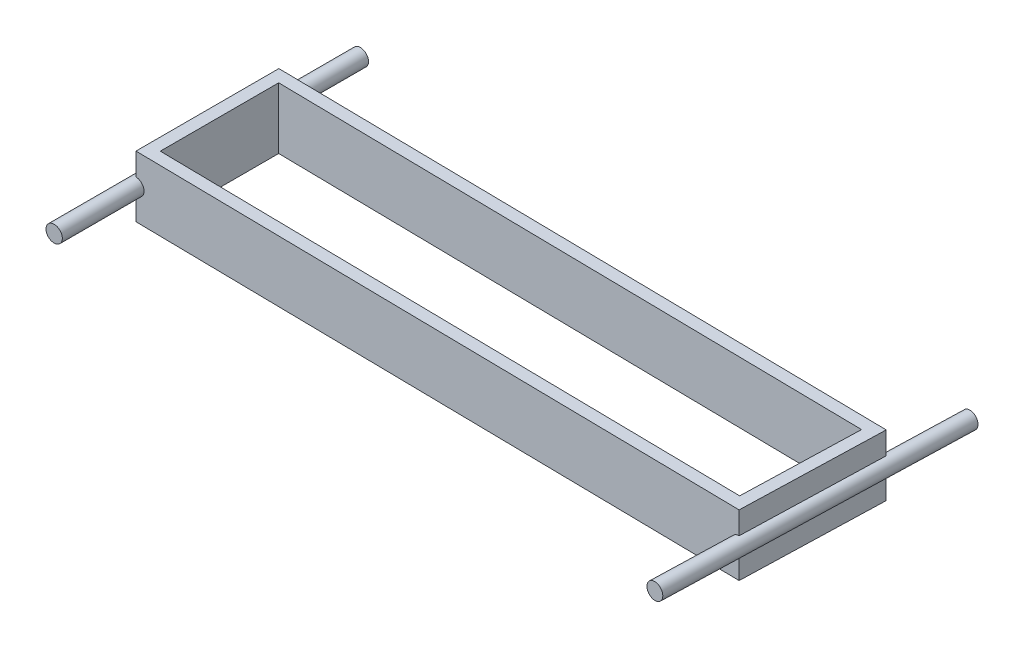
ISO-10303-21;
HEADER;
FILE_DESCRIPTION(('STEP AP214'),'2;1');
FILE_NAME('part.step','',(''),(''),'','','');
FILE_SCHEMA(('AUTOMOTIVE_DESIGN { 1 0 10303 214 1 1 1 1 }'));
ENDSEC;
DATA;
#1=APPLICATION_CONTEXT('core data for automotive mechanical design processes');
#2=APPLICATION_PROTOCOL_DEFINITION('international standard','automotive_design',2000,#1);
#3=PRODUCT_CONTEXT('',#1,'mechanical');
#4=PRODUCT('Part','Part','',(#3));
#5=PRODUCT_RELATED_PRODUCT_CATEGORY('part','',(#4));
#6=PRODUCT_DEFINITION_FORMATION('','',#4);
#7=PRODUCT_DEFINITION_CONTEXT('part definition',#1,'design');
#8=PRODUCT_DEFINITION('design','',#6,#7);
#9=PRODUCT_DEFINITION_SHAPE('','',#8);
#10=(LENGTH_UNIT() NAMED_UNIT(*) SI_UNIT(.MILLI.,.METRE.));
#11=(NAMED_UNIT(*) PLANE_ANGLE_UNIT() SI_UNIT($,.RADIAN.));
#12=(NAMED_UNIT(*) SI_UNIT($,.STERADIAN.) SOLID_ANGLE_UNIT());
#13=UNCERTAINTY_MEASURE_WITH_UNIT(LENGTH_MEASURE(1.E-05),#10,'distance_accuracy_value','');
#14=(GEOMETRIC_REPRESENTATION_CONTEXT(3) GLOBAL_UNCERTAINTY_ASSIGNED_CONTEXT((#13)) GLOBAL_UNIT_ASSIGNED_CONTEXT((#10,
#11,#12)) REPRESENTATION_CONTEXT('',''));
#15=CARTESIAN_POINT('',(0.,0.,0.));
#16=DIRECTION('',(0.,0.,1.));
#17=DIRECTION('',(1.,0.,0.));
#18=AXIS2_PLACEMENT_3D('',#15,#16,#17);
#19=CARTESIAN_POINT('',(57.3784840671414,-38.1,50.0506871390915));
#20=DIRECTION('',(0.99955,0.,0.0299966248101393));
#21=DIRECTION('',(0.0299966248101393,0.,-0.99955));
#22=AXIS2_PLACEMENT_3D('',#19,#20,#21);
#23=PLANE('',#22);
#24=DIRECTION('',(0.0299966248101393,0.,-0.99955));
#25=VECTOR('',#24,1.);
#26=CARTESIAN_POINT('',(55.8512265267866,-24.13,100.942088559213));
#27=LINE('',#26,#25);
#28=CARTESIAN_POINT('',(57.3784840671414,-24.13,50.0506871390915));
#29=VERTEX_POINT('',#28);
#30=CARTESIAN_POINT('',(60.0451840127628,-24.13,-38.8093078609085));
#31=VERTEX_POINT('',#30);
#32=EDGE_CURVE('E138',#29,#31,#27,.T.);
#33=ORIENTED_EDGE('',*,*,#32,.F.);
#34=DIRECTION('',(0.,1.,0.));
#35=VECTOR('',#34,1.);
#36=CARTESIAN_POINT('',(57.3784840671414,-38.1,50.0506871390915));
#37=LINE('',#36,#35);
#38=CARTESIAN_POINT('',(57.3784840671414,-38.1,50.0506871390915));
#39=VERTEX_POINT('',#38);
#40=EDGE_CURVE('E126',#39,#29,#37,.T.);
#41=ORIENTED_EDGE('',*,*,#40,.F.);
#42=DIRECTION('',(0.0299966248101393,0.,-0.99955));
#43=VECTOR('',#42,1.);
#44=CARTESIAN_POINT('',(57.3784840671414,-38.1,50.0506871390915));
#45=LINE('',#44,#43);
#46=CARTESIAN_POINT('',(60.0451840127628,-38.1,-38.8093078609085));
#47=VERTEX_POINT('',#46);
#48=EDGE_CURVE('E205',#39,#47,#45,.T.);
#49=ORIENTED_EDGE('',*,*,#48,.T.);
#50=DIRECTION('',(0.,1.,0.));
#51=VECTOR('',#50,1.);
#52=CARTESIAN_POINT('',(60.0451840127628,-38.1,-38.8093078609085));
#53=LINE('',#52,#51);
#54=EDGE_CURVE('E139',#47,#31,#53,.T.);
#55=ORIENTED_EDGE('',*,*,#54,.T.);
#56=EDGE_LOOP('',(#33,#41,#49,#55));
#57=FACE_BOUND('',#56,.T.);
#58=ADVANCED_FACE('F37',(#57),#23,.T.);
#59=CARTESIAN_POINT('',(-323.578651021572,-38.1,44.3356871390794));
#60=DIRECTION('',(-1.,0.,0.));
#61=DIRECTION('',(0.,0.,1.));
#62=AXIS2_PLACEMENT_3D('',#59,#60,#61);
#63=PLANE('',#62);
#64=DIRECTION('',(0.,1.,0.));
#65=VECTOR('',#64,1.);
#66=CARTESIAN_POINT('',(-323.578651021572,-38.1,-44.5643128609206));
#67=LINE('',#66,#65);
#68=CARTESIAN_POINT('',(-323.578651021572,-13.97,-44.5643128609206));
#69=VERTEX_POINT('',#68);
#70=CARTESIAN_POINT('',(-323.578651021572,0.,-44.5643128609206));
#71=VERTEX_POINT('',#70);
#72=EDGE_CURVE('E224',#69,#71,#67,.T.);
#73=ORIENTED_EDGE('',*,*,#72,.F.);
#74=DIRECTION('',(0.,0.,-1.));
#75=VECTOR('',#74,1.);
#76=CARTESIAN_POINT('',(-323.578651021572,-13.97,95.25));
#77=LINE('',#76,#75);
#78=CARTESIAN_POINT('',(-323.578651021572,-13.9700000000001,44.3356871390794));
#79=VERTEX_POINT('',#78);
#80=EDGE_CURVE('E161',#69,#79,#77,.F.);
#81=ORIENTED_EDGE('',*,*,#80,.T.);
#82=DIRECTION('',(0.,1.,0.));
#83=VECTOR('',#82,1.);
#84=CARTESIAN_POINT('',(-323.578651021572,-38.1,44.3356871390794));
#85=LINE('',#84,#83);
#86=CARTESIAN_POINT('',(-323.578651021572,0.,44.3356871390794));
#87=VERTEX_POINT('',#86);
#88=EDGE_CURVE('E210',#79,#87,#85,.T.);
#89=ORIENTED_EDGE('',*,*,#88,.T.);
#90=DIRECTION('',(0.,0.,1.));
#91=VECTOR('',#90,1.);
#92=CARTESIAN_POINT('',(-323.578651021572,0.,44.3356871390794));
#93=LINE('',#92,#91);
#94=EDGE_CURVE('E193',#71,#87,#93,.T.);
#95=ORIENTED_EDGE('',*,*,#94,.F.);
#96=EDGE_LOOP('',(#73,#81,#89,#95));
#97=FACE_BOUND('',#96,.T.);
#98=ADVANCED_FACE('F39',(#97),#63,.T.);
#99=CARTESIAN_POINT('',(-323.578651021572,-38.1,44.3356871390794));
#100=VERTEX_POINT('',#99);
#101=CARTESIAN_POINT('',(-323.578651021572,-24.13,44.3356871390794));
#102=VERTEX_POINT('',#101);
#103=EDGE_CURVE('E226',#100,#102,#85,.T.);
#104=ORIENTED_EDGE('',*,*,#103,.T.);
#105=DIRECTION('',(0.,0.,-1.));
#106=VECTOR('',#105,1.);
#107=CARTESIAN_POINT('',(-323.578651021572,-24.13,95.25));
#108=LINE('',#107,#106);
#109=CARTESIAN_POINT('',(-323.578651021572,-24.13,-44.5643128609206));
#110=VERTEX_POINT('',#109);
#111=EDGE_CURVE('E156',#102,#110,#108,.T.);
#112=ORIENTED_EDGE('',*,*,#111,.T.);
#113=CARTESIAN_POINT('',(-323.578651021572,-38.1,-44.5643128609206));
#114=VERTEX_POINT('',#113);
#115=EDGE_CURVE('E221',#114,#110,#67,.T.);
#116=ORIENTED_EDGE('',*,*,#115,.F.);
#117=DIRECTION('',(0.,0.,1.));
#118=VECTOR('',#117,1.);
#119=CARTESIAN_POINT('',(-323.578651021572,-38.1,44.3356871390794));
#120=LINE('',#119,#118);
#121=EDGE_CURVE('E200',#114,#100,#120,.T.);
#122=ORIENTED_EDGE('',*,*,#121,.T.);
#123=EDGE_LOOP('',(#104,#112,#116,#122));
#124=FACE_BOUND('',#123,.T.);
#125=ADVANCED_FACE('F233',(#124),#63,.T.);
#126=CARTESIAN_POINT('',(-323.578651021572,-38.1,-44.5643128609206));
#127=DIRECTION('',(0.0150000000000314,0.,-0.999887493671162));
#128=DIRECTION('',(-0.999887493671163,0.,-0.0150000000000314));
#129=AXIS2_PLACEMENT_3D('',#126,#127,#128);
#130=PLANE('',#129);
#131=CARTESIAN_POINT('',(60.0451840127626,-19.05,-38.8093078609085));
#132=DIRECTION('',(0.0150000000000314,0.,-0.999887493671162));
#133=DIRECTION('',(0.999887493671163,0.,0.0150000000000314));
#134=AXIS2_PLACEMENT_3D('',#131,#132,#133);
#135=ELLIPSE('',#134,5.08057159645867,5.07999999999996);
#136=CARTESIAN_POINT('',(60.0451840127628,-13.97,-38.8093078609085));
#137=VERTEX_POINT('',#136);
#138=EDGE_CURVE('E59',#31,#137,#135,.T.);
#139=ORIENTED_EDGE('',*,*,#138,.F.);
#140=ORIENTED_EDGE('',*,*,#54,.F.);
#141=DIRECTION('',(-0.999887493671162,0.,-0.0150000000000314));
#142=VECTOR('',#141,1.);
#143=CARTESIAN_POINT('',(-323.578651021572,-38.1,-44.5643128609206));
#144=LINE('',#143,#142);
#145=EDGE_CURVE('E207',#47,#114,#144,.T.);
#146=ORIENTED_EDGE('',*,*,#145,.T.);
#147=ORIENTED_EDGE('',*,*,#115,.T.);
#148=CARTESIAN_POINT('',(-323.578651021572,-19.05,-44.5643128609206));
#149=DIRECTION('',(0.0150000000000314,0.,-0.999887493671162));
#150=DIRECTION('',(-0.999887493671163,0.,-0.0150000000000314));
#151=AXIS2_PLACEMENT_3D('',#148,#149,#150);
#152=ELLIPSE('',#151,5.08057159645868,5.07999999999996);
#153=EDGE_CURVE('E164',#110,#69,#152,.F.);
#154=ORIENTED_EDGE('',*,*,#153,.T.);
#155=ORIENTED_EDGE('',*,*,#72,.T.);
#156=DIRECTION('',(-0.999887493671162,0.,-0.0150000000000314));
#157=VECTOR('',#156,1.);
#158=CARTESIAN_POINT('',(-323.578651021572,0.,-44.5643128609206));
#159=LINE('',#158,#157);
#160=CARTESIAN_POINT('',(60.0451840127628,0.,-38.8093078609085));
#161=VERTEX_POINT('',#160);
#162=EDGE_CURVE('E203',#161,#71,#159,.T.);
#163=ORIENTED_EDGE('',*,*,#162,.F.);
#164=EDGE_CURVE('E134',#137,#161,#53,.T.);
#165=ORIENTED_EDGE('',*,*,#164,.F.);
#166=EDGE_LOOP('',(#139,#140,#146,#147,#154,#155,#163,#165));
#167=FACE_BOUND('',#166,.T.);
#168=ADVANCED_FACE('F238',(#167),#130,.T.);
#169=DIRECTION('',(0.0299966248101393,0.,-0.99955));
#170=VECTOR('',#169,1.);
#171=CARTESIAN_POINT('',(55.8512265267866,-13.97,100.942088559213));
#172=LINE('',#171,#170);
#173=CARTESIAN_POINT('',(57.3784840671414,-13.97,50.0506871390915));
#174=VERTEX_POINT('',#173);
#175=EDGE_CURVE('E52',#137,#174,#172,.F.);
#176=ORIENTED_EDGE('',*,*,#175,.F.);
#177=ORIENTED_EDGE('',*,*,#164,.T.);
#178=DIRECTION('',(0.0299966248101393,0.,-0.99955));
#179=VECTOR('',#178,1.);
#180=CARTESIAN_POINT('',(57.3784840671414,0.,50.0506871390915));
#181=LINE('',#180,#179);
#182=CARTESIAN_POINT('',(57.3784840671414,0.,50.0506871390915));
#183=VERTEX_POINT('',#182);
#184=EDGE_CURVE('E216',#183,#161,#181,.T.);
#185=ORIENTED_EDGE('',*,*,#184,.F.);
#186=EDGE_CURVE('E135',#174,#183,#37,.T.);
#187=ORIENTED_EDGE('',*,*,#186,.F.);
#188=EDGE_LOOP('',(#176,#177,#185,#187));
#189=FACE_BOUND('',#188,.T.);
#190=ADVANCED_FACE('F246',(#189),#23,.T.);
#191=CARTESIAN_POINT('',(-323.578651021572,-38.1,44.3356871390794));
#192=DIRECTION('',(-0.0150000000000316,0.,0.999887493671162));
#193=DIRECTION('',(0.999887493671163,0.,0.0150000000000316));
#194=AXIS2_PLACEMENT_3D('',#191,#192,#193);
#195=PLANE('',#194);
#196=CARTESIAN_POINT('',(57.3784840671413,-19.05,50.0506871390915));
#197=DIRECTION('',(-0.0150000000000316,0.,0.999887493671162));
#198=DIRECTION('',(0.999887493671163,0.,0.0150000000000316));
#199=AXIS2_PLACEMENT_3D('',#196,#197,#198);
#200=ELLIPSE('',#199,5.08057159645867,5.07999999999996);
#201=EDGE_CURVE('E11',#174,#29,#200,.T.);
#202=ORIENTED_EDGE('',*,*,#201,.F.);
#203=ORIENTED_EDGE('',*,*,#186,.T.);
#204=DIRECTION('',(0.999887493671163,0.,0.0150000000000316));
#205=VECTOR('',#204,1.);
#206=CARTESIAN_POINT('',(-323.578651021572,0.,44.3356871390794));
#207=LINE('',#206,#205);
#208=EDGE_CURVE('E213',#87,#183,#207,.T.);
#209=ORIENTED_EDGE('',*,*,#208,.F.);
#210=ORIENTED_EDGE('',*,*,#88,.F.);
#211=CARTESIAN_POINT('',(-323.578651021572,-19.05,44.3356871390794));
#212=DIRECTION('',(-0.0150000000000316,0.,0.999887493671162));
#213=DIRECTION('',(-0.999887493671163,0.,-0.0150000000000316));
#214=AXIS2_PLACEMENT_3D('',#211,#212,#213);
#215=ELLIPSE('',#214,5.08057159645868,5.07999999999996);
#216=EDGE_CURVE('E45',#79,#102,#215,.F.);
#217=ORIENTED_EDGE('',*,*,#216,.T.);
#218=ORIENTED_EDGE('',*,*,#103,.F.);
#219=DIRECTION('',(0.999887493671163,0.,0.0150000000000316));
#220=VECTOR('',#219,1.);
#221=CARTESIAN_POINT('',(-323.578651021572,-38.1,44.3356871390794));
#222=LINE('',#221,#220);
#223=EDGE_CURVE('E130',#100,#39,#222,.T.);
#224=ORIENTED_EDGE('',*,*,#223,.T.);
#225=ORIENTED_EDGE('',*,*,#40,.T.);
#226=EDGE_LOOP('',(#202,#203,#209,#210,#217,#218,#224,#225));
#227=FACE_BOUND('',#226,.T.);
#228=ADVANCED_FACE('F128',(#227),#195,.T.);
#229=CARTESIAN_POINT('',(0.,-38.1,0.));
#230=DIRECTION('',(0.,-1.,0.));
#231=DIRECTION('',(0.,0.,-1.));
#232=AXIS2_PLACEMENT_3D('',#229,#230,#231);
#233=PLANE('',#232);
#234=DIRECTION('',(0.,0.,1.));
#235=VECTOR('',#234,1.);
#236=CARTESIAN_POINT('',(-315.958651021572,-38.1,36.8291426053119));
#237=LINE('',#236,#235);
#238=CARTESIAN_POINT('',(-315.958651021572,-38.1,-36.8291426053119));
#239=VERTEX_POINT('',#238);
#240=CARTESIAN_POINT('',(-315.958651021572,-38.1,36.8291426053119));
#241=VERTEX_POINT('',#240);
#242=EDGE_CURVE('E168',#239,#241,#237,.T.);
#243=ORIENTED_EDGE('',*,*,#242,.T.);
#244=DIRECTION('',(0.999887493671162,0.,0.0150000000000316));
#245=VECTOR('',#244,1.);
#246=CARTESIAN_POINT('',(-315.958651021572,-38.1,36.8291426053119));
#247=LINE('',#246,#245);
#248=CARTESIAN_POINT('',(49.9870840671414,-38.1,42.3189462693105));
#249=VERTEX_POINT('',#248);
#250=EDGE_CURVE('E171',#241,#249,#247,.T.);
#251=ORIENTED_EDGE('',*,*,#250,.T.);
#252=DIRECTION('',(0.0299966248101396,0.,-0.99955));
#253=VECTOR('',#252,1.);
#254=CARTESIAN_POINT('',(49.9870840671414,-38.1,42.3189462693105));
#255=LINE('',#254,#253);
#256=CARTESIAN_POINT('',(52.1965840127628,-38.1,-31.3061927129686));
#257=VERTEX_POINT('',#256);
#258=EDGE_CURVE('E175',#249,#257,#255,.T.);
#259=ORIENTED_EDGE('',*,*,#258,.T.);
#260=DIRECTION('',(-0.999887493671163,0.,-0.0150000000000314));
#261=VECTOR('',#260,1.);
#262=CARTESIAN_POINT('',(-315.958651021572,-38.1,-36.8291426053119));
#263=LINE('',#262,#261);
#264=EDGE_CURVE('E178',#257,#239,#263,.T.);
#265=ORIENTED_EDGE('',*,*,#264,.T.);
#266=EDGE_LOOP('',(#243,#251,#259,#265));
#267=FACE_BOUND('',#266,.T.);
#268=ORIENTED_EDGE('',*,*,#121,.F.);
#269=ORIENTED_EDGE('',*,*,#145,.F.);
#270=ORIENTED_EDGE('',*,*,#48,.F.);
#271=ORIENTED_EDGE('',*,*,#223,.F.);
#272=EDGE_LOOP('',(#268,#269,#270,#271));
#273=FACE_BOUND('',#272,.T.);
#274=ADVANCED_FACE('F237',(#267,#273),#233,.T.);
#275=CARTESIAN_POINT('',(0.,0.,0.));
#276=DIRECTION('',(0.,-1.,0.));
#277=DIRECTION('',(0.,0.,-1.));
#278=AXIS2_PLACEMENT_3D('',#275,#276,#277);
#279=PLANE('',#278);
#280=DIRECTION('',(0.999887493671162,0.,0.0150000000000316));
#281=VECTOR('',#280,1.);
#282=CARTESIAN_POINT('',(-315.958651021572,0.,36.8291426053119));
#283=LINE('',#282,#281);
#284=CARTESIAN_POINT('',(-315.958651021571,0.,36.8291426053119));
#285=VERTEX_POINT('',#284);
#286=CARTESIAN_POINT('',(49.9870840671414,0.,42.3189462693105));
#287=VERTEX_POINT('',#286);
#288=EDGE_CURVE('E183',#285,#287,#283,.T.);
#289=ORIENTED_EDGE('',*,*,#288,.F.);
#290=DIRECTION('',(0.,0.,1.));
#291=VECTOR('',#290,1.);
#292=CARTESIAN_POINT('',(-315.958651021572,0.,36.8291426053119));
#293=LINE('',#292,#291);
#294=CARTESIAN_POINT('',(-315.958651021572,0.,-36.8291426053119));
#295=VERTEX_POINT('',#294);
#296=EDGE_CURVE('E167',#295,#285,#293,.T.);
#297=ORIENTED_EDGE('',*,*,#296,.F.);
#298=DIRECTION('',(-0.999887493671163,0.,-0.0150000000000314));
#299=VECTOR('',#298,1.);
#300=CARTESIAN_POINT('',(-315.958651021572,0.,-36.8291426053119));
#301=LINE('',#300,#299);
#302=CARTESIAN_POINT('',(52.1965840127628,0.,-31.3061927129686));
#303=VERTEX_POINT('',#302);
#304=EDGE_CURVE('E172',#303,#295,#301,.T.);
#305=ORIENTED_EDGE('',*,*,#304,.F.);
#306=DIRECTION('',(0.0299966248101396,0.,-0.99955));
#307=VECTOR('',#306,1.);
#308=CARTESIAN_POINT('',(49.9870840671414,0.,42.3189462693105));
#309=LINE('',#308,#307);
#310=EDGE_CURVE('E186',#287,#303,#309,.T.);
#311=ORIENTED_EDGE('',*,*,#310,.F.);
#312=EDGE_LOOP('',(#289,#297,#305,#311));
#313=FACE_BOUND('',#312,.T.);
#314=ORIENTED_EDGE('',*,*,#94,.T.);
#315=ORIENTED_EDGE('',*,*,#208,.T.);
#316=ORIENTED_EDGE('',*,*,#184,.T.);
#317=ORIENTED_EDGE('',*,*,#162,.T.);
#318=EDGE_LOOP('',(#314,#315,#316,#317));
#319=FACE_BOUND('',#318,.T.);
#320=ADVANCED_FACE('F244',(#313,#319),#279,.F.);
#321=CARTESIAN_POINT('',(-315.958651021572,-38.1,36.8291426053119));
#322=DIRECTION('',(-1.,0.,0.));
#323=DIRECTION('',(0.,0.,1.));
#324=AXIS2_PLACEMENT_3D('',#321,#322,#323);
#325=PLANE('',#324);
#326=ORIENTED_EDGE('',*,*,#296,.T.);
#327=DIRECTION('',(0.,1.,0.));
#328=VECTOR('',#327,1.);
#329=CARTESIAN_POINT('',(-315.958651021572,-38.1,36.8291426053119));
#330=LINE('',#329,#328);
#331=EDGE_CURVE('E181',#241,#285,#330,.T.);
#332=ORIENTED_EDGE('',*,*,#331,.F.);
#333=ORIENTED_EDGE('',*,*,#242,.F.);
#334=DIRECTION('',(0.,1.,0.));
#335=VECTOR('',#334,1.);
#336=CARTESIAN_POINT('',(-315.958651021572,-38.1,-36.8291426053119));
#337=LINE('',#336,#335);
#338=EDGE_CURVE('E191',#239,#295,#337,.T.);
#339=ORIENTED_EDGE('',*,*,#338,.T.);
#340=EDGE_LOOP('',(#326,#332,#333,#339));
#341=FACE_BOUND('',#340,.T.);
#342=ADVANCED_FACE('F333',(#341),#325,.F.);
#343=CARTESIAN_POINT('',(-315.958651021572,-38.1,-36.8291426053119));
#344=DIRECTION('',(0.0150000000000314,0.,-0.999887493671162));
#345=DIRECTION('',(-0.999887493671163,0.,-0.0150000000000314));
#346=AXIS2_PLACEMENT_3D('',#343,#344,#345);
#347=PLANE('',#346);
#348=ORIENTED_EDGE('',*,*,#304,.T.);
#349=ORIENTED_EDGE('',*,*,#338,.F.);
#350=ORIENTED_EDGE('',*,*,#264,.F.);
#351=DIRECTION('',(0.,1.,0.));
#352=VECTOR('',#351,1.);
#353=CARTESIAN_POINT('',(52.1965840127628,-38.1,-31.3061927129686));
#354=LINE('',#353,#352);
#355=EDGE_CURVE('E194',#257,#303,#354,.T.);
#356=ORIENTED_EDGE('',*,*,#355,.T.);
#357=EDGE_LOOP('',(#348,#349,#350,#356));
#358=FACE_BOUND('',#357,.T.);
#359=ADVANCED_FACE('F329',(#358),#347,.F.);
#360=CARTESIAN_POINT('',(49.9870840671414,-38.1,42.3189462693105));
#361=DIRECTION('',(0.99955,0.,0.0299966248101396));
#362=DIRECTION('',(0.0299966248101397,0.,-0.99955));
#363=AXIS2_PLACEMENT_3D('',#360,#361,#362);
#364=PLANE('',#363);
#365=ORIENTED_EDGE('',*,*,#310,.T.);
#366=ORIENTED_EDGE('',*,*,#355,.F.);
#367=ORIENTED_EDGE('',*,*,#258,.F.);
#368=DIRECTION('',(0.,1.,0.));
#369=VECTOR('',#368,1.);
#370=CARTESIAN_POINT('',(49.9870840671414,-38.1,42.3189462693105));
#371=LINE('',#370,#369);
#372=EDGE_CURVE('E196',#249,#287,#371,.T.);
#373=ORIENTED_EDGE('',*,*,#372,.T.);
#374=EDGE_LOOP('',(#365,#366,#367,#373));
#375=FACE_BOUND('',#374,.T.);
#376=ADVANCED_FACE('F332',(#375),#364,.F.);
#377=CARTESIAN_POINT('',(-315.958651021572,-38.1,36.8291426053119));
#378=DIRECTION('',(-0.0150000000000316,0.,0.999887493671163));
#379=DIRECTION('',(0.999887493671163,0.,0.0150000000000316));
#380=AXIS2_PLACEMENT_3D('',#377,#378,#379);
#381=PLANE('',#380);
#382=ORIENTED_EDGE('',*,*,#288,.T.);
#383=ORIENTED_EDGE('',*,*,#372,.F.);
#384=ORIENTED_EDGE('',*,*,#250,.F.);
#385=ORIENTED_EDGE('',*,*,#331,.T.);
#386=EDGE_LOOP('',(#382,#383,#384,#385));
#387=FACE_BOUND('',#386,.T.);
#388=ADVANCED_FACE('F328',(#387),#381,.F.);
#389=CARTESIAN_POINT('',(-323.578651021572,-19.05,95.25));
#390=DIRECTION('',(0.,0.,-1.));
#391=DIRECTION('',(-1.,0.,0.));
#392=AXIS2_PLACEMENT_3D('',#389,#390,#391);
#393=CYLINDRICAL_SURFACE('',#392,5.07999999999996);
#394=ORIENTED_EDGE('',*,*,#153,.F.);
#395=ORIENTED_EDGE('',*,*,#111,.F.);
#396=ORIENTED_EDGE('',*,*,#216,.F.);
#397=ORIENTED_EDGE('',*,*,#80,.F.);
#398=EDGE_LOOP('',(#394,#395,#396,#397));
#399=FACE_BOUND('',#398,.T.);
#400=CARTESIAN_POINT('',(-323.578651021572,-19.05,95.25));
#401=DIRECTION('',(0.,0.,1.));
#402=DIRECTION('',(1.,0.,0.));
#403=AXIS2_PLACEMENT_3D('',#400,#401,#402);
#404=CIRCLE('',#403,5.07999999999996);
#405=CARTESIAN_POINT('',(-318.498651021572,-19.05,95.25));
#406=VERTEX_POINT('',#405);
#407=EDGE_CURVE('E153',#406,#406,#404,.T.);
#408=ORIENTED_EDGE('',*,*,#407,.F.);
#409=EDGE_LOOP('',(#408));
#410=FACE_BOUND('',#409,.T.);
#411=CARTESIAN_POINT('',(-323.578651021572,-19.05,-95.25));
#412=DIRECTION('',(0.,0.,1.));
#413=DIRECTION('',(1.,0.,0.));
#414=AXIS2_PLACEMENT_3D('',#411,#412,#413);
#415=CIRCLE('',#414,5.07999999999996);
#416=CARTESIAN_POINT('',(-318.498651021572,-19.05,-95.25));
#417=VERTEX_POINT('',#416);
#418=EDGE_CURVE('E152',#417,#417,#415,.T.);
#419=ORIENTED_EDGE('',*,*,#418,.T.);
#420=EDGE_LOOP('',(#419));
#421=FACE_BOUND('',#420,.T.);
#422=ADVANCED_FACE('F322',(#399,#410,#421),#393,.T.);
#423=CARTESIAN_POINT('',(-323.578651021572,-19.05,95.25));
#424=DIRECTION('',(0.,0.,1.));
#425=DIRECTION('',(1.,0.,0.));
#426=AXIS2_PLACEMENT_3D('',#423,#424,#425);
#427=PLANE('',#426);
#428=ORIENTED_EDGE('',*,*,#407,.T.);
#429=EDGE_LOOP('',(#428));
#430=FACE_BOUND('',#429,.T.);
#431=ADVANCED_FACE('F319',(#430),#427,.T.);
#432=CARTESIAN_POINT('',(-323.578651021572,-19.05,-95.25));
#433=DIRECTION('',(0.,0.,1.));
#434=DIRECTION('',(1.,0.,0.));
#435=AXIS2_PLACEMENT_3D('',#432,#433,#434);
#436=PLANE('',#435);
#437=ORIENTED_EDGE('',*,*,#418,.F.);
#438=EDGE_LOOP('',(#437));
#439=FACE_BOUND('',#438,.T.);
#440=ADVANCED_FACE('F293',(#439),#436,.F.);
#441=CARTESIAN_POINT('',(55.8512265267865,-19.05,100.942088559213));
#442=DIRECTION('',(0.0299966248101393,0.,-0.99955));
#443=DIRECTION('',(-0.99955,0.,-0.0299966248101393));
#444=AXIS2_PLACEMENT_3D('',#441,#442,#443);
#445=CYLINDRICAL_SURFACE('',#444,5.07999999999996);
#446=ORIENTED_EDGE('',*,*,#32,.T.);
#447=ORIENTED_EDGE('',*,*,#138,.T.);
#448=ORIENTED_EDGE('',*,*,#175,.T.);
#449=ORIENTED_EDGE('',*,*,#201,.T.);
#450=EDGE_LOOP('',(#446,#447,#448,#449));
#451=FACE_BOUND('',#450,.T.);
#452=CARTESIAN_POINT('',(55.8512265267865,-19.05,100.942088559213));
#453=DIRECTION('',(0.0299966248101393,0.,-0.99955));
#454=DIRECTION('',(-0.99955,0.,-0.0299966248101393));
#455=AXIS2_PLACEMENT_3D('',#452,#453,#454);
#456=CIRCLE('',#455,5.07999999999996);
#457=CARTESIAN_POINT('',(50.7735125267866,-19.05,100.789705705178));
#458=VERTEX_POINT('',#457);
#459=EDGE_CURVE('E144',#458,#458,#456,.T.);
#460=ORIENTED_EDGE('',*,*,#459,.T.);
#461=EDGE_LOOP('',(#460));
#462=FACE_BOUND('',#461,.T.);
#463=CARTESIAN_POINT('',(61.5655835531181,-19.05,-89.4721864407866));
#464=DIRECTION('',(0.0299966248101393,0.,-0.99955));
#465=DIRECTION('',(-0.99955,0.,-0.0299966248101393));
#466=AXIS2_PLACEMENT_3D('',#463,#464,#465);
#467=CIRCLE('',#466,5.07999999999996);
#468=CARTESIAN_POINT('',(56.4878695531181,-19.05,-89.6245692948221));
#469=VERTEX_POINT('',#468);
#470=EDGE_CURVE('E147',#469,#469,#467,.T.);
#471=ORIENTED_EDGE('',*,*,#470,.F.);
#472=EDGE_LOOP('',(#471));
#473=FACE_BOUND('',#472,.T.);
#474=ADVANCED_FACE('F142',(#451,#462,#473),#445,.T.);
#475=CARTESIAN_POINT('',(55.8512265267865,-19.05,100.942088559213));
#476=DIRECTION('',(-0.0299966248101393,0.,0.99955));
#477=DIRECTION('',(-0.99955,0.,-0.0299966248101393));
#478=AXIS2_PLACEMENT_3D('',#475,#476,#477);
#479=PLANE('',#478);
#480=ORIENTED_EDGE('',*,*,#459,.F.);
#481=EDGE_LOOP('',(#480));
#482=FACE_BOUND('',#481,.T.);
#483=ADVANCED_FACE('F292',(#482),#479,.T.);
#484=CARTESIAN_POINT('',(61.5655835531181,-19.05,-89.4721864407866));
#485=DIRECTION('',(-0.0299966248101393,0.,0.99955));
#486=DIRECTION('',(-0.99955,0.,-0.0299966248101393));
#487=AXIS2_PLACEMENT_3D('',#484,#485,#486);
#488=PLANE('',#487);
#489=ORIENTED_EDGE('',*,*,#470,.T.);
#490=EDGE_LOOP('',(#489));
#491=FACE_BOUND('',#490,.T.);
#492=ADVANCED_FACE('F303',(#491),#488,.F.);
#493=CLOSED_SHELL('',(#58,#98,#125,#168,#190,#228,#274,#320,#342,#359,#376,#388,#422,#431,#440,
#474,#483,#492));
#494=MANIFOLD_SOLID_BREP('B2',#493);
#495=ADVANCED_BREP_SHAPE_REPRESENTATION('',(#18,#494),#14);
#496=SHAPE_DEFINITION_REPRESENTATION(#9,#495);
ENDSEC;
END-ISO-10303-21;
